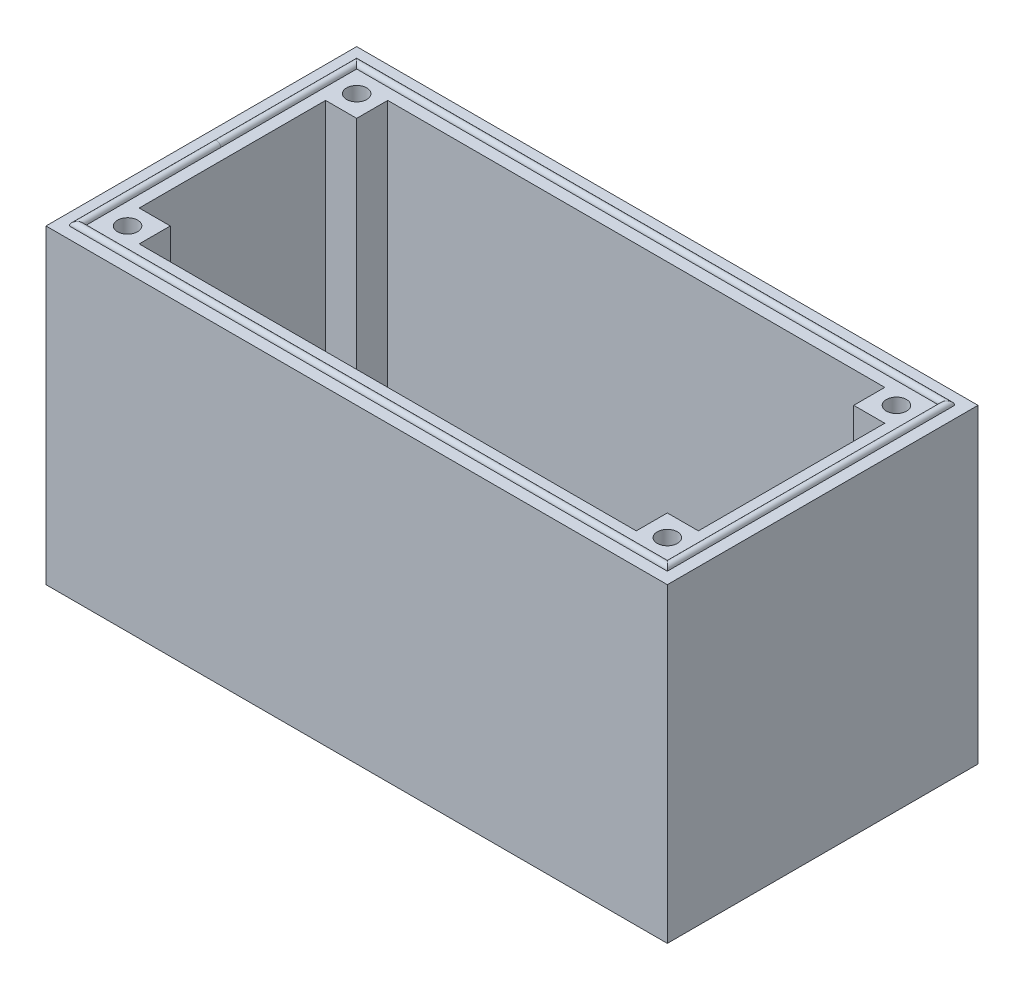
ISO-10303-21;
HEADER;
FILE_DESCRIPTION(('STEP AP214'),'2;1');
FILE_NAME('part.step','',(''),(''),'','','');
FILE_SCHEMA(('AUTOMOTIVE_DESIGN { 1 0 10303 214 1 1 1 1 }'));
ENDSEC;
DATA;
#1=APPLICATION_CONTEXT('core data for automotive mechanical design processes');
#2=APPLICATION_PROTOCOL_DEFINITION('international standard','automotive_design',2000,#1);
#3=PRODUCT_CONTEXT('',#1,'mechanical');
#4=PRODUCT('Part','Part','',(#3));
#5=PRODUCT_RELATED_PRODUCT_CATEGORY('part','',(#4));
#6=PRODUCT_DEFINITION_FORMATION('','',#4);
#7=PRODUCT_DEFINITION_CONTEXT('part definition',#1,'design');
#8=PRODUCT_DEFINITION('design','',#6,#7);
#9=PRODUCT_DEFINITION_SHAPE('','',#8);
#10=(LENGTH_UNIT() NAMED_UNIT(*) SI_UNIT(.MILLI.,.METRE.));
#11=(NAMED_UNIT(*) PLANE_ANGLE_UNIT() SI_UNIT($,.RADIAN.));
#12=(NAMED_UNIT(*) SI_UNIT($,.STERADIAN.) SOLID_ANGLE_UNIT());
#13=UNCERTAINTY_MEASURE_WITH_UNIT(LENGTH_MEASURE(1.E-05),#10,'distance_accuracy_value','');
#14=(GEOMETRIC_REPRESENTATION_CONTEXT(3) GLOBAL_UNCERTAINTY_ASSIGNED_CONTEXT((#13)) GLOBAL_UNIT_ASSIGNED_CONTEXT((#10,
#11,#12)) REPRESENTATION_CONTEXT('',''));
#15=CARTESIAN_POINT('',(0.,0.,0.));
#16=DIRECTION('',(0.,0.,1.));
#17=DIRECTION('',(1.,0.,0.));
#18=AXIS2_PLACEMENT_3D('',#15,#16,#17);
#19=CARTESIAN_POINT('',(40.,0.,-20.));
#20=DIRECTION('',(0.,-1.,0.));
#21=DIRECTION('',(0.,0.,-1.));
#22=AXIS2_PLACEMENT_3D('',#19,#20,#21);
#23=PLANE('',#22);
#24=CARTESIAN_POINT('',(2.62500000000001,0.,-17.375));
#25=DIRECTION('',(0.,-1.,0.));
#26=DIRECTION('',(0.,0.,-1.));
#27=AXIS2_PLACEMENT_3D('',#24,#25,#26);
#28=CIRCLE('',#27,0.675);
#29=CARTESIAN_POINT('',(2.62500000000001,0.,-18.05));
#30=VERTEX_POINT('',#29);
#31=EDGE_CURVE('E789',#30,#30,#28,.T.);
#32=ORIENTED_EDGE('',*,*,#31,.F.);
#33=EDGE_LOOP('',(#32));
#34=FACE_BOUND('',#33,.T.);
#35=CARTESIAN_POINT('',(2.62500000000001,0.,-2.625));
#36=DIRECTION('',(0.,-1.,0.));
#37=DIRECTION('',(0.,0.,-1.));
#38=AXIS2_PLACEMENT_3D('',#35,#36,#37);
#39=CIRCLE('',#38,0.675);
#40=CARTESIAN_POINT('',(2.62500000000001,0.,-3.3));
#41=VERTEX_POINT('',#40);
#42=EDGE_CURVE('E433',#41,#41,#39,.T.);
#43=ORIENTED_EDGE('',*,*,#42,.F.);
#44=EDGE_LOOP('',(#43));
#45=FACE_BOUND('',#44,.T.);
#46=CARTESIAN_POINT('',(37.375,0.,-2.625));
#47=DIRECTION('',(0.,-1.,0.));
#48=DIRECTION('',(0.,0.,-1.));
#49=AXIS2_PLACEMENT_3D('',#46,#47,#48);
#50=CIRCLE('',#49,0.675000000000002);
#51=CARTESIAN_POINT('',(37.375,0.,-3.3));
#52=VERTEX_POINT('',#51);
#53=EDGE_CURVE('E426',#52,#52,#50,.T.);
#54=ORIENTED_EDGE('',*,*,#53,.F.);
#55=EDGE_LOOP('',(#54));
#56=FACE_BOUND('',#55,.T.);
#57=CARTESIAN_POINT('',(37.375,0.,-17.375));
#58=DIRECTION('',(0.,-1.,0.));
#59=DIRECTION('',(0.,0.,-1.));
#60=AXIS2_PLACEMENT_3D('',#57,#58,#59);
#61=CIRCLE('',#60,0.675000000000002);
#62=CARTESIAN_POINT('',(37.375,0.,-18.05));
#63=VERTEX_POINT('',#62);
#64=EDGE_CURVE('E422',#63,#63,#61,.T.);
#65=ORIENTED_EDGE('',*,*,#64,.F.);
#66=EDGE_LOOP('',(#65));
#67=FACE_BOUND('',#66,.T.);
#68=DIRECTION('',(-1.,0.,0.));
#69=VECTOR('',#68,1.);
#70=CARTESIAN_POINT('',(39.375,0.,-18.75));
#71=LINE('',#70,#69);
#72=CARTESIAN_POINT('',(38.75,0.,-18.75));
#73=VERTEX_POINT('',#72);
#74=CARTESIAN_POINT('',(1.25000000000001,0.,-18.75));
#75=VERTEX_POINT('',#74);
#76=EDGE_CURVE('E250',#73,#75,#71,.T.);
#77=ORIENTED_EDGE('',*,*,#76,.F.);
#78=DIRECTION('',(0.,0.,-1.));
#79=VECTOR('',#78,1.);
#80=CARTESIAN_POINT('',(38.75,0.,-0.625000000000001));
#81=LINE('',#80,#79);
#82=CARTESIAN_POINT('',(38.75,0.,-1.25));
#83=VERTEX_POINT('',#82);
#84=EDGE_CURVE('E450',#83,#73,#81,.T.);
#85=ORIENTED_EDGE('',*,*,#84,.F.);
#86=DIRECTION('',(1.,0.,0.));
#87=VECTOR('',#86,1.);
#88=CARTESIAN_POINT('',(0.625000000000002,0.,-1.25));
#89=LINE('',#88,#87);
#90=CARTESIAN_POINT('',(1.25,0.,-1.25));
#91=VERTEX_POINT('',#90);
#92=EDGE_CURVE('E234',#91,#83,#89,.T.);
#93=ORIENTED_EDGE('',*,*,#92,.F.);
#94=DIRECTION('',(0.,0.,1.));
#95=VECTOR('',#94,1.);
#96=CARTESIAN_POINT('',(1.25,0.,-10.));
#97=LINE('',#96,#95);
#98=CARTESIAN_POINT('',(1.25,0.,-10.));
#99=VERTEX_POINT('',#98);
#100=EDGE_CURVE('E63',#99,#91,#97,.T.);
#101=ORIENTED_EDGE('',*,*,#100,.F.);
#102=DIRECTION('',(0.,0.,1.));
#103=VECTOR('',#102,1.);
#104=CARTESIAN_POINT('',(1.25,0.,-19.375));
#105=LINE('',#104,#103);
#106=EDGE_CURVE('E254',#75,#99,#105,.T.);
#107=ORIENTED_EDGE('',*,*,#106,.F.);
#108=EDGE_LOOP('',(#77,#85,#93,#101,#107));
#109=FACE_BOUND('',#108,.T.);
#110=DIRECTION('',(0.,0.,1.));
#111=VECTOR('',#110,1.);
#112=CARTESIAN_POINT('',(36.,0.,-3.99999999999999));
#113=LINE('',#112,#111);
#114=CARTESIAN_POINT('',(36.,0.,-3.99999999999999));
#115=VERTEX_POINT('',#114);
#116=CARTESIAN_POINT('',(36.,0.,-2.));
#117=VERTEX_POINT('',#116);
#118=EDGE_CURVE('E298',#115,#117,#113,.T.);
#119=ORIENTED_EDGE('',*,*,#118,.F.);
#120=DIRECTION('',(-1.,0.,0.));
#121=VECTOR('',#120,1.);
#122=CARTESIAN_POINT('',(38.,0.,-4.));
#123=LINE('',#122,#121);
#124=CARTESIAN_POINT('',(38.,0.,-4.));
#125=VERTEX_POINT('',#124);
#126=EDGE_CURVE('E296',#125,#115,#123,.T.);
#127=ORIENTED_EDGE('',*,*,#126,.F.);
#128=DIRECTION('',(0.,0.,-1.));
#129=VECTOR('',#128,1.);
#130=CARTESIAN_POINT('',(38.,0.,-4.));
#131=LINE('',#130,#129);
#132=CARTESIAN_POINT('',(38.,0.,-16.));
#133=VERTEX_POINT('',#132);
#134=EDGE_CURVE('E325',#125,#133,#131,.T.);
#135=ORIENTED_EDGE('',*,*,#134,.T.);
#136=DIRECTION('',(1.,0.,0.));
#137=VECTOR('',#136,1.);
#138=CARTESIAN_POINT('',(36.,0.,-16.));
#139=LINE('',#138,#137);
#140=CARTESIAN_POINT('',(36.,0.,-16.));
#141=VERTEX_POINT('',#140);
#142=EDGE_CURVE('E322',#141,#133,#139,.T.);
#143=ORIENTED_EDGE('',*,*,#142,.F.);
#144=DIRECTION('',(0.,0.,1.));
#145=VECTOR('',#144,1.);
#146=CARTESIAN_POINT('',(36.,0.,-18.));
#147=LINE('',#146,#145);
#148=CARTESIAN_POINT('',(36.,0.,-18.));
#149=VERTEX_POINT('',#148);
#150=EDGE_CURVE('E320',#149,#141,#147,.T.);
#151=ORIENTED_EDGE('',*,*,#150,.F.);
#152=DIRECTION('',(-1.,0.,0.));
#153=VECTOR('',#152,1.);
#154=CARTESIAN_POINT('',(36.,0.,-18.));
#155=LINE('',#154,#153);
#156=CARTESIAN_POINT('',(3.99999999999999,0.,-18.));
#157=VERTEX_POINT('',#156);
#158=EDGE_CURVE('E317',#149,#157,#155,.T.);
#159=ORIENTED_EDGE('',*,*,#158,.T.);
#160=DIRECTION('',(0.,0.,1.));
#161=VECTOR('',#160,1.);
#162=CARTESIAN_POINT('',(3.99999999999999,0.,-18.));
#163=LINE('',#162,#161);
#164=CARTESIAN_POINT('',(3.99999999999999,0.,-16.));
#165=VERTEX_POINT('',#164);
#166=EDGE_CURVE('E314',#157,#165,#163,.T.);
#167=ORIENTED_EDGE('',*,*,#166,.T.);
#168=DIRECTION('',(-1.,0.,0.));
#169=VECTOR('',#168,1.);
#170=CARTESIAN_POINT('',(3.99999999999999,0.,-16.));
#171=LINE('',#170,#169);
#172=CARTESIAN_POINT('',(2.,0.,-16.));
#173=VERTEX_POINT('',#172);
#174=EDGE_CURVE('E311',#165,#173,#171,.T.);
#175=ORIENTED_EDGE('',*,*,#174,.T.);
#176=DIRECTION('',(0.,0.,-1.));
#177=VECTOR('',#176,1.);
#178=CARTESIAN_POINT('',(2.,0.,-3.99999999999999));
#179=LINE('',#178,#177);
#180=CARTESIAN_POINT('',(2.,0.,-3.99999999999999));
#181=VERTEX_POINT('',#180);
#182=EDGE_CURVE('E309',#181,#173,#179,.T.);
#183=ORIENTED_EDGE('',*,*,#182,.F.);
#184=DIRECTION('',(1.,0.,0.));
#185=VECTOR('',#184,1.);
#186=CARTESIAN_POINT('',(2.,0.,-3.99999999999999));
#187=LINE('',#186,#185);
#188=CARTESIAN_POINT('',(3.99999999999999,0.,-3.99999999999999));
#189=VERTEX_POINT('',#188);
#190=EDGE_CURVE('E306',#181,#189,#187,.T.);
#191=ORIENTED_EDGE('',*,*,#190,.T.);
#192=DIRECTION('',(0.,0.,1.));
#193=VECTOR('',#192,1.);
#194=CARTESIAN_POINT('',(3.99999999999999,0.,-3.99999999999999));
#195=LINE('',#194,#193);
#196=CARTESIAN_POINT('',(3.99999999999999,0.,-2.));
#197=VERTEX_POINT('',#196);
#198=EDGE_CURVE('E303',#189,#197,#195,.T.);
#199=ORIENTED_EDGE('',*,*,#198,.T.);
#200=DIRECTION('',(-1.,0.,0.));
#201=VECTOR('',#200,1.);
#202=CARTESIAN_POINT('',(36.,0.,-2.));
#203=LINE('',#202,#201);
#204=EDGE_CURVE('E301',#117,#197,#203,.T.);
#205=ORIENTED_EDGE('',*,*,#204,.F.);
#206=EDGE_LOOP('',(#119,#127,#135,#143,#151,#159,#167,#175,#183,#191,#199,#205));
#207=FACE_BOUND('',#206,.T.);
#208=ADVANCED_FACE('F46',(#34,#45,#56,#67,#109,#207),#23,.T.);
#209=CARTESIAN_POINT('',(0.,20.,-20.));
#210=DIRECTION('',(0.,1.,0.));
#211=DIRECTION('',(0.,0.,1.));
#212=AXIS2_PLACEMENT_3D('',#209,#210,#211);
#213=PLANE('',#212);
#214=CARTESIAN_POINT('',(2.62500000000001,20.,-17.375));
#215=DIRECTION('',(0.,1.,0.));
#216=DIRECTION('',(0.,0.,1.));
#217=AXIS2_PLACEMENT_3D('',#214,#215,#216);
#218=CIRCLE('',#217,0.649999999999992);
#219=CARTESIAN_POINT('',(2.62500000000001,20.,-16.725));
#220=VERTEX_POINT('',#219);
#221=EDGE_CURVE('E50',#220,#220,#218,.T.);
#222=ORIENTED_EDGE('',*,*,#221,.F.);
#223=EDGE_LOOP('',(#222));
#224=FACE_BOUND('',#223,.T.);
#225=CARTESIAN_POINT('',(2.62500000000001,20.,-2.625));
#226=DIRECTION('',(0.,1.,0.));
#227=DIRECTION('',(0.,0.,1.));
#228=AXIS2_PLACEMENT_3D('',#225,#226,#227);
#229=CIRCLE('',#228,0.649999999999992);
#230=CARTESIAN_POINT('',(2.62500000000001,20.,-1.97500000000001));
#231=VERTEX_POINT('',#230);
#232=EDGE_CURVE('E424',#231,#231,#229,.T.);
#233=ORIENTED_EDGE('',*,*,#232,.F.);
#234=EDGE_LOOP('',(#233));
#235=FACE_BOUND('',#234,.T.);
#236=CARTESIAN_POINT('',(37.375,20.,-2.625));
#237=DIRECTION('',(0.,1.,0.));
#238=DIRECTION('',(0.,0.,1.));
#239=AXIS2_PLACEMENT_3D('',#236,#237,#238);
#240=CIRCLE('',#239,0.649999999999991);
#241=CARTESIAN_POINT('',(37.375,20.,-1.97500000000001));
#242=VERTEX_POINT('',#241);
#243=EDGE_CURVE('E420',#242,#242,#240,.T.);
#244=ORIENTED_EDGE('',*,*,#243,.F.);
#245=EDGE_LOOP('',(#244));
#246=FACE_BOUND('',#245,.T.);
#247=CARTESIAN_POINT('',(37.375,20.,-17.375));
#248=DIRECTION('',(0.,1.,0.));
#249=DIRECTION('',(0.,0.,1.));
#250=AXIS2_PLACEMENT_3D('',#247,#248,#249);
#251=CIRCLE('',#250,0.649999999999991);
#252=CARTESIAN_POINT('',(37.375,20.,-16.725));
#253=VERTEX_POINT('',#252);
#254=EDGE_CURVE('E251',#253,#253,#251,.T.);
#255=ORIENTED_EDGE('',*,*,#254,.F.);
#256=EDGE_LOOP('',(#255));
#257=FACE_BOUND('',#256,.T.);
#258=DIRECTION('',(0.,0.,-1.));
#259=VECTOR('',#258,1.);
#260=CARTESIAN_POINT('',(38.,20.,-4.));
#261=LINE('',#260,#259);
#262=CARTESIAN_POINT('',(38.,20.,-4.));
#263=VERTEX_POINT('',#262);
#264=CARTESIAN_POINT('',(38.,20.,-16.));
#265=VERTEX_POINT('',#264);
#266=EDGE_CURVE('E299',#263,#265,#261,.T.);
#267=ORIENTED_EDGE('',*,*,#266,.F.);
#268=DIRECTION('',(-1.,0.,0.));
#269=VECTOR('',#268,1.);
#270=CARTESIAN_POINT('',(38.,20.,-4.));
#271=LINE('',#270,#269);
#272=CARTESIAN_POINT('',(36.,20.,-3.99999999999999));
#273=VERTEX_POINT('',#272);
#274=EDGE_CURVE('E267',#263,#273,#271,.T.);
#275=ORIENTED_EDGE('',*,*,#274,.T.);
#276=DIRECTION('',(0.,0.,1.));
#277=VECTOR('',#276,1.);
#278=CARTESIAN_POINT('',(36.,20.,-3.99999999999999));
#279=LINE('',#278,#277);
#280=CARTESIAN_POINT('',(36.,20.,-2.));
#281=VERTEX_POINT('',#280);
#282=EDGE_CURVE('E331',#273,#281,#279,.T.);
#283=ORIENTED_EDGE('',*,*,#282,.T.);
#284=DIRECTION('',(-1.,0.,0.));
#285=VECTOR('',#284,1.);
#286=CARTESIAN_POINT('',(36.,20.,-2.));
#287=LINE('',#286,#285);
#288=CARTESIAN_POINT('',(3.99999999999999,20.,-2.));
#289=VERTEX_POINT('',#288);
#290=EDGE_CURVE('E334',#281,#289,#287,.T.);
#291=ORIENTED_EDGE('',*,*,#290,.T.);
#292=DIRECTION('',(0.,0.,1.));
#293=VECTOR('',#292,1.);
#294=CARTESIAN_POINT('',(3.99999999999999,20.,-3.99999999999999));
#295=LINE('',#294,#293);
#296=CARTESIAN_POINT('',(3.99999999999999,20.,-3.99999999999999));
#297=VERTEX_POINT('',#296);
#298=EDGE_CURVE('E337',#297,#289,#295,.T.);
#299=ORIENTED_EDGE('',*,*,#298,.F.);
#300=DIRECTION('',(1.,0.,0.));
#301=VECTOR('',#300,1.);
#302=CARTESIAN_POINT('',(2.,20.,-3.99999999999999));
#303=LINE('',#302,#301);
#304=CARTESIAN_POINT('',(2.,20.,-3.99999999999999));
#305=VERTEX_POINT('',#304);
#306=EDGE_CURVE('E340',#305,#297,#303,.T.);
#307=ORIENTED_EDGE('',*,*,#306,.F.);
#308=DIRECTION('',(0.,0.,-1.));
#309=VECTOR('',#308,1.);
#310=CARTESIAN_POINT('',(2.,20.,-3.99999999999999));
#311=LINE('',#310,#309);
#312=CARTESIAN_POINT('',(2.,20.,-16.));
#313=VERTEX_POINT('',#312);
#314=EDGE_CURVE('E343',#305,#313,#311,.T.);
#315=ORIENTED_EDGE('',*,*,#314,.T.);
#316=DIRECTION('',(-1.,0.,0.));
#317=VECTOR('',#316,1.);
#318=CARTESIAN_POINT('',(3.99999999999999,20.,-16.));
#319=LINE('',#318,#317);
#320=CARTESIAN_POINT('',(3.99999999999999,20.,-16.));
#321=VERTEX_POINT('',#320);
#322=EDGE_CURVE('E346',#321,#313,#319,.T.);
#323=ORIENTED_EDGE('',*,*,#322,.F.);
#324=DIRECTION('',(0.,0.,1.));
#325=VECTOR('',#324,1.);
#326=CARTESIAN_POINT('',(3.99999999999999,20.,-18.));
#327=LINE('',#326,#325);
#328=CARTESIAN_POINT('',(3.99999999999999,20.,-18.));
#329=VERTEX_POINT('',#328);
#330=EDGE_CURVE('E349',#329,#321,#327,.T.);
#331=ORIENTED_EDGE('',*,*,#330,.F.);
#332=DIRECTION('',(-1.,0.,0.));
#333=VECTOR('',#332,1.);
#334=CARTESIAN_POINT('',(36.,20.,-18.));
#335=LINE('',#334,#333);
#336=CARTESIAN_POINT('',(36.,20.,-18.));
#337=VERTEX_POINT('',#336);
#338=EDGE_CURVE('E352',#337,#329,#335,.T.);
#339=ORIENTED_EDGE('',*,*,#338,.F.);
#340=DIRECTION('',(0.,0.,1.));
#341=VECTOR('',#340,1.);
#342=CARTESIAN_POINT('',(36.,20.,-18.));
#343=LINE('',#342,#341);
#344=CARTESIAN_POINT('',(36.,20.,-16.));
#345=VERTEX_POINT('',#344);
#346=EDGE_CURVE('E355',#337,#345,#343,.T.);
#347=ORIENTED_EDGE('',*,*,#346,.T.);
#348=DIRECTION('',(1.,0.,0.));
#349=VECTOR('',#348,1.);
#350=CARTESIAN_POINT('',(36.,20.,-16.));
#351=LINE('',#350,#349);
#352=EDGE_CURVE('E358',#345,#265,#351,.T.);
#353=ORIENTED_EDGE('',*,*,#352,.T.);
#354=EDGE_LOOP('',(#267,#275,#283,#291,#299,#307,#315,#323,#331,#339,#347,#353));
#355=FACE_BOUND('',#354,.T.);
#356=DIRECTION('',(0.,0.,-1.));
#357=VECTOR('',#356,1.);
#358=CARTESIAN_POINT('',(1.24999999999999,20.,-0.624999999999994));
#359=LINE('',#358,#357);
#360=CARTESIAN_POINT('',(1.24999999999999,20.,-1.24999999999999));
#361=VERTEX_POINT('',#360);
#362=CARTESIAN_POINT('',(1.24999999999999,20.,-10.));
#363=VERTEX_POINT('',#362);
#364=EDGE_CURVE('E276',#361,#363,#359,.T.);
#365=ORIENTED_EDGE('',*,*,#364,.F.);
#366=DIRECTION('',(-1.,0.,0.));
#367=VECTOR('',#366,1.);
#368=CARTESIAN_POINT('',(39.375,20.,-1.24999999999999));
#369=LINE('',#368,#367);
#370=CARTESIAN_POINT('',(38.75,20.,-1.24999999999999));
#371=VERTEX_POINT('',#370);
#372=EDGE_CURVE('E279',#371,#361,#369,.T.);
#373=ORIENTED_EDGE('',*,*,#372,.F.);
#374=DIRECTION('',(0.,0.,1.));
#375=VECTOR('',#374,1.);
#376=CARTESIAN_POINT('',(38.75,20.,-19.375));
#377=LINE('',#376,#375);
#378=CARTESIAN_POINT('',(38.75,20.,-18.75));
#379=VERTEX_POINT('',#378);
#380=EDGE_CURVE('E271',#379,#371,#377,.T.);
#381=ORIENTED_EDGE('',*,*,#380,.F.);
#382=DIRECTION('',(1.,0.,0.));
#383=VECTOR('',#382,1.);
#384=CARTESIAN_POINT('',(0.624999999999994,20.,-18.75));
#385=LINE('',#384,#383);
#386=CARTESIAN_POINT('',(1.25,20.,-18.75));
#387=VERTEX_POINT('',#386);
#388=EDGE_CURVE('E264',#387,#379,#385,.T.);
#389=ORIENTED_EDGE('',*,*,#388,.F.);
#390=DIRECTION('',(0.,0.,-1.));
#391=VECTOR('',#390,1.);
#392=CARTESIAN_POINT('',(1.24999999999999,20.,-10.));
#393=LINE('',#392,#391);
#394=EDGE_CURVE('E287',#363,#387,#393,.T.);
#395=ORIENTED_EDGE('',*,*,#394,.F.);
#396=EDGE_LOOP('',(#365,#373,#381,#389,#395));
#397=FACE_BOUND('',#396,.T.);
#398=ADVANCED_FACE('F485',(#224,#235,#246,#257,#355,#397),#213,.T.);
#399=DIRECTION('',(-1.,0.,0.));
#400=VECTOR('',#399,1.);
#401=CARTESIAN_POINT('',(0.,20.,0.));
#402=LINE('',#401,#400);
#403=CARTESIAN_POINT('',(40.,20.,0.));
#404=VERTEX_POINT('',#403);
#405=CARTESIAN_POINT('',(0.,20.,0.));
#406=VERTEX_POINT('',#405);
#407=EDGE_CURVE('E408',#404,#406,#402,.T.);
#408=ORIENTED_EDGE('',*,*,#407,.F.);
#409=DIRECTION('',(0.,0.,1.));
#410=VECTOR('',#409,1.);
#411=CARTESIAN_POINT('',(40.,20.,-20.));
#412=LINE('',#411,#410);
#413=CARTESIAN_POINT('',(40.,20.,-20.));
#414=VERTEX_POINT('',#413);
#415=EDGE_CURVE('E414',#414,#404,#412,.T.);
#416=ORIENTED_EDGE('',*,*,#415,.F.);
#417=DIRECTION('',(-1.,0.,0.));
#418=VECTOR('',#417,1.);
#419=CARTESIAN_POINT('',(0.,20.,-20.));
#420=LINE('',#419,#418);
#421=CARTESIAN_POINT('',(0.,20.,-20.));
#422=VERTEX_POINT('',#421);
#423=EDGE_CURVE('E396',#414,#422,#420,.T.);
#424=ORIENTED_EDGE('',*,*,#423,.T.);
#425=DIRECTION('',(0.,0.,1.));
#426=VECTOR('',#425,1.);
#427=CARTESIAN_POINT('',(0.,20.,-20.));
#428=LINE('',#427,#426);
#429=EDGE_CURVE('E55',#422,#406,#428,.T.);
#430=ORIENTED_EDGE('',*,*,#429,.T.);
#431=EDGE_LOOP('',(#408,#416,#424,#430));
#432=FACE_BOUND('',#431,.T.);
#433=DIRECTION('',(0.,0.,1.));
#434=VECTOR('',#433,1.);
#435=CARTESIAN_POINT('',(39.25,20.,-19.375));
#436=LINE('',#435,#434);
#437=CARTESIAN_POINT('',(39.25,20.,-19.25));
#438=VERTEX_POINT('',#437);
#439=CARTESIAN_POINT('',(39.25,20.,-0.749999999999993));
#440=VERTEX_POINT('',#439);
#441=EDGE_CURVE('E268',#438,#440,#436,.T.);
#442=ORIENTED_EDGE('',*,*,#441,.T.);
#443=DIRECTION('',(-1.,0.,0.));
#444=VECTOR('',#443,1.);
#445=CARTESIAN_POINT('',(39.375,20.,-0.749999999999993));
#446=LINE('',#445,#444);
#447=CARTESIAN_POINT('',(0.749999999999993,20.,-0.749999999999994));
#448=VERTEX_POINT('',#447);
#449=EDGE_CURVE('E291',#440,#448,#446,.T.);
#450=ORIENTED_EDGE('',*,*,#449,.T.);
#451=DIRECTION('',(0.,0.,-1.));
#452=VECTOR('',#451,1.);
#453=CARTESIAN_POINT('',(0.749999999999993,20.,-0.624999999999994));
#454=LINE('',#453,#452);
#455=CARTESIAN_POINT('',(0.749999999999993,20.,-10.));
#456=VERTEX_POINT('',#455);
#457=EDGE_CURVE('E278',#448,#456,#454,.T.);
#458=ORIENTED_EDGE('',*,*,#457,.T.);
#459=DIRECTION('',(0.,0.,-1.));
#460=VECTOR('',#459,1.);
#461=CARTESIAN_POINT('',(0.749999999999993,20.,-10.));
#462=LINE('',#461,#460);
#463=CARTESIAN_POINT('',(0.749999999999994,20.,-19.25));
#464=VERTEX_POINT('',#463);
#465=EDGE_CURVE('E284',#456,#464,#462,.T.);
#466=ORIENTED_EDGE('',*,*,#465,.T.);
#467=DIRECTION('',(1.,0.,0.));
#468=VECTOR('',#467,1.);
#469=CARTESIAN_POINT('',(0.624999999999994,20.,-19.25));
#470=LINE('',#469,#468);
#471=EDGE_CURVE('E257',#464,#438,#470,.T.);
#472=ORIENTED_EDGE('',*,*,#471,.T.);
#473=EDGE_LOOP('',(#442,#450,#458,#466,#472));
#474=FACE_BOUND('',#473,.T.);
#475=ADVANCED_FACE('F491',(#432,#474),#213,.T.);
#476=DIRECTION('',(-1.,0.,0.));
#477=VECTOR('',#476,1.);
#478=CARTESIAN_POINT('',(39.375,0.,-19.25));
#479=LINE('',#478,#477);
#480=CARTESIAN_POINT('',(39.25,0.,-19.25));
#481=VERTEX_POINT('',#480);
#482=CARTESIAN_POINT('',(0.750000000000004,0.,-19.25));
#483=VERTEX_POINT('',#482);
#484=EDGE_CURVE('E248',#481,#483,#479,.T.);
#485=ORIENTED_EDGE('',*,*,#484,.T.);
#486=DIRECTION('',(0.,0.,1.));
#487=VECTOR('',#486,1.);
#488=CARTESIAN_POINT('',(0.750000000000001,0.,-19.375));
#489=LINE('',#488,#487);
#490=CARTESIAN_POINT('',(0.750000000000001,0.,-10.));
#491=VERTEX_POINT('',#490);
#492=EDGE_CURVE('E240',#483,#491,#489,.T.);
#493=ORIENTED_EDGE('',*,*,#492,.T.);
#494=DIRECTION('',(0.,0.,1.));
#495=VECTOR('',#494,1.);
#496=CARTESIAN_POINT('',(0.750000000000001,0.,-10.));
#497=LINE('',#496,#495);
#498=CARTESIAN_POINT('',(0.750000000000001,0.,-0.750000000000002));
#499=VERTEX_POINT('',#498);
#500=EDGE_CURVE('E222',#491,#499,#497,.T.);
#501=ORIENTED_EDGE('',*,*,#500,.T.);
#502=DIRECTION('',(1.,0.,0.));
#503=VECTOR('',#502,1.);
#504=CARTESIAN_POINT('',(0.625000000000002,0.,-0.750000000000002));
#505=LINE('',#504,#503);
#506=CARTESIAN_POINT('',(39.25,0.,-0.750000000000001));
#507=VERTEX_POINT('',#506);
#508=EDGE_CURVE('E231',#499,#507,#505,.T.);
#509=ORIENTED_EDGE('',*,*,#508,.T.);
#510=DIRECTION('',(0.,0.,-1.));
#511=VECTOR('',#510,1.);
#512=CARTESIAN_POINT('',(39.25,0.,-0.625000000000001));
#513=LINE('',#512,#511);
#514=EDGE_CURVE('E71',#507,#481,#513,.T.);
#515=ORIENTED_EDGE('',*,*,#514,.T.);
#516=EDGE_LOOP('',(#485,#493,#501,#509,#515));
#517=FACE_BOUND('',#516,.T.);
#518=DIRECTION('',(1.,0.,0.));
#519=VECTOR('',#518,1.);
#520=CARTESIAN_POINT('',(40.,0.,0.));
#521=LINE('',#520,#519);
#522=CARTESIAN_POINT('',(0.,0.,0.));
#523=VERTEX_POINT('',#522);
#524=CARTESIAN_POINT('',(40.,0.,0.));
#525=VERTEX_POINT('',#524);
#526=EDGE_CURVE('E388',#523,#525,#521,.T.);
#527=ORIENTED_EDGE('',*,*,#526,.F.);
#528=DIRECTION('',(0.,0.,1.));
#529=VECTOR('',#528,1.);
#530=CARTESIAN_POINT('',(0.,0.,-20.));
#531=LINE('',#530,#529);
#532=CARTESIAN_POINT('',(0.,0.,-20.));
#533=VERTEX_POINT('',#532);
#534=EDGE_CURVE('E11',#533,#523,#531,.T.);
#535=ORIENTED_EDGE('',*,*,#534,.F.);
#536=DIRECTION('',(1.,0.,0.));
#537=VECTOR('',#536,1.);
#538=CARTESIAN_POINT('',(40.,0.,-20.));
#539=LINE('',#538,#537);
#540=CARTESIAN_POINT('',(40.,0.,-20.));
#541=VERTEX_POINT('',#540);
#542=EDGE_CURVE('E389',#533,#541,#539,.T.);
#543=ORIENTED_EDGE('',*,*,#542,.T.);
#544=DIRECTION('',(0.,0.,1.));
#545=VECTOR('',#544,1.);
#546=CARTESIAN_POINT('',(40.,0.,-20.));
#547=LINE('',#546,#545);
#548=EDGE_CURVE('E402',#541,#525,#547,.T.);
#549=ORIENTED_EDGE('',*,*,#548,.T.);
#550=EDGE_LOOP('',(#527,#535,#543,#549));
#551=FACE_BOUND('',#550,.T.);
#552=ADVANCED_FACE('F48',(#517,#551),#23,.T.);
#553=CARTESIAN_POINT('',(0.,0.,-20.));
#554=DIRECTION('',(-1.,0.,0.));
#555=DIRECTION('',(0.,-1.,0.));
#556=AXIS2_PLACEMENT_3D('',#553,#554,#555);
#557=PLANE('',#556);
#558=DIRECTION('',(0.,-1.,0.));
#559=VECTOR('',#558,1.);
#560=CARTESIAN_POINT('',(0.,0.,0.));
#561=LINE('',#560,#559);
#562=EDGE_CURVE('E393',#406,#523,#561,.T.);
#563=ORIENTED_EDGE('',*,*,#562,.F.);
#564=ORIENTED_EDGE('',*,*,#429,.F.);
#565=DIRECTION('',(0.,-1.,0.));
#566=VECTOR('',#565,1.);
#567=CARTESIAN_POINT('',(0.,0.,-20.));
#568=LINE('',#567,#566);
#569=EDGE_CURVE('E399',#422,#533,#568,.T.);
#570=ORIENTED_EDGE('',*,*,#569,.T.);
#571=ORIENTED_EDGE('',*,*,#534,.T.);
#572=EDGE_LOOP('',(#563,#564,#570,#571));
#573=FACE_BOUND('',#572,.T.);
#574=ADVANCED_FACE('F497',(#573),#557,.T.);
#575=CARTESIAN_POINT('',(40.,20.,-20.));
#576=DIRECTION('',(1.,0.,0.));
#577=DIRECTION('',(0.,1.,0.));
#578=AXIS2_PLACEMENT_3D('',#575,#576,#577);
#579=PLANE('',#578);
#580=DIRECTION('',(0.,1.,0.));
#581=VECTOR('',#580,1.);
#582=CARTESIAN_POINT('',(40.,20.,0.));
#583=LINE('',#582,#581);
#584=EDGE_CURVE('E405',#525,#404,#583,.T.);
#585=ORIENTED_EDGE('',*,*,#584,.F.);
#586=ORIENTED_EDGE('',*,*,#548,.F.);
#587=DIRECTION('',(0.,1.,0.));
#588=VECTOR('',#587,1.);
#589=CARTESIAN_POINT('',(40.,20.,-20.));
#590=LINE('',#589,#588);
#591=EDGE_CURVE('E392',#541,#414,#590,.T.);
#592=ORIENTED_EDGE('',*,*,#591,.T.);
#593=ORIENTED_EDGE('',*,*,#415,.T.);
#594=EDGE_LOOP('',(#585,#586,#592,#593));
#595=FACE_BOUND('',#594,.T.);
#596=ADVANCED_FACE('F502',(#595),#579,.T.);
#597=CARTESIAN_POINT('',(0.,0.,-20.));
#598=DIRECTION('',(0.,0.,-1.));
#599=DIRECTION('',(-1.,0.,0.));
#600=AXIS2_PLACEMENT_3D('',#597,#598,#599);
#601=PLANE('',#600);
#602=ORIENTED_EDGE('',*,*,#542,.F.);
#603=ORIENTED_EDGE('',*,*,#569,.F.);
#604=ORIENTED_EDGE('',*,*,#423,.F.);
#605=ORIENTED_EDGE('',*,*,#591,.F.);
#606=EDGE_LOOP('',(#602,#603,#604,#605));
#607=FACE_BOUND('',#606,.T.);
#608=ADVANCED_FACE('F515',(#607),#601,.T.);
#609=CARTESIAN_POINT('',(0.,0.,0.));
#610=DIRECTION('',(0.,0.,-1.));
#611=DIRECTION('',(-1.,0.,0.));
#612=AXIS2_PLACEMENT_3D('',#609,#610,#611);
#613=PLANE('',#612);
#614=ORIENTED_EDGE('',*,*,#526,.T.);
#615=ORIENTED_EDGE('',*,*,#584,.T.);
#616=ORIENTED_EDGE('',*,*,#407,.T.);
#617=ORIENTED_EDGE('',*,*,#562,.T.);
#618=EDGE_LOOP('',(#614,#615,#616,#617));
#619=FACE_BOUND('',#618,.T.);
#620=ADVANCED_FACE('F520',(#619),#613,.F.);
#621=CARTESIAN_POINT('',(38.,0.,-4.));
#622=DIRECTION('',(0.,0.,-1.));
#623=DIRECTION('',(-1.,0.,0.));
#624=AXIS2_PLACEMENT_3D('',#621,#622,#623);
#625=PLANE('',#624);
#626=ORIENTED_EDGE('',*,*,#274,.F.);
#627=DIRECTION('',(0.,1.,0.));
#628=VECTOR('',#627,1.);
#629=CARTESIAN_POINT('',(38.,0.,-4.));
#630=LINE('',#629,#628);
#631=EDGE_CURVE('E328',#125,#263,#630,.T.);
#632=ORIENTED_EDGE('',*,*,#631,.F.);
#633=ORIENTED_EDGE('',*,*,#126,.T.);
#634=DIRECTION('',(0.,1.,0.));
#635=VECTOR('',#634,1.);
#636=CARTESIAN_POINT('',(36.,0.,-3.99999999999999));
#637=LINE('',#636,#635);
#638=EDGE_CURVE('E385',#115,#273,#637,.T.);
#639=ORIENTED_EDGE('',*,*,#638,.T.);
#640=EDGE_LOOP('',(#626,#632,#633,#639));
#641=FACE_BOUND('',#640,.T.);
#642=ADVANCED_FACE('F532',(#641),#625,.T.);
#643=CARTESIAN_POINT('',(36.,0.,-3.99999999999999));
#644=DIRECTION('',(-1.,0.,0.));
#645=DIRECTION('',(0.,0.,1.));
#646=AXIS2_PLACEMENT_3D('',#643,#644,#645);
#647=PLANE('',#646);
#648=ORIENTED_EDGE('',*,*,#282,.F.);
#649=ORIENTED_EDGE('',*,*,#638,.F.);
#650=ORIENTED_EDGE('',*,*,#118,.T.);
#651=DIRECTION('',(0.,1.,0.));
#652=VECTOR('',#651,1.);
#653=CARTESIAN_POINT('',(36.,0.,-2.));
#654=LINE('',#653,#652);
#655=EDGE_CURVE('E383',#117,#281,#654,.T.);
#656=ORIENTED_EDGE('',*,*,#655,.T.);
#657=EDGE_LOOP('',(#648,#649,#650,#656));
#658=FACE_BOUND('',#657,.T.);
#659=ADVANCED_FACE('F537',(#658),#647,.T.);
#660=CARTESIAN_POINT('',(36.,0.,-2.));
#661=DIRECTION('',(0.,0.,-1.));
#662=DIRECTION('',(-1.,0.,0.));
#663=AXIS2_PLACEMENT_3D('',#660,#661,#662);
#664=PLANE('',#663);
#665=ORIENTED_EDGE('',*,*,#290,.F.);
#666=ORIENTED_EDGE('',*,*,#655,.F.);
#667=ORIENTED_EDGE('',*,*,#204,.T.);
#668=DIRECTION('',(0.,1.,0.));
#669=VECTOR('',#668,1.);
#670=CARTESIAN_POINT('',(3.99999999999999,0.,-2.));
#671=LINE('',#670,#669);
#672=EDGE_CURVE('E381',#197,#289,#671,.T.);
#673=ORIENTED_EDGE('',*,*,#672,.T.);
#674=EDGE_LOOP('',(#665,#666,#667,#673));
#675=FACE_BOUND('',#674,.T.);
#676=ADVANCED_FACE('F543',(#675),#664,.T.);
#677=CARTESIAN_POINT('',(3.99999999999999,0.,-3.99999999999999));
#678=DIRECTION('',(-1.,0.,0.));
#679=DIRECTION('',(0.,0.,1.));
#680=AXIS2_PLACEMENT_3D('',#677,#678,#679);
#681=PLANE('',#680);
#682=ORIENTED_EDGE('',*,*,#298,.T.);
#683=ORIENTED_EDGE('',*,*,#672,.F.);
#684=ORIENTED_EDGE('',*,*,#198,.F.);
#685=DIRECTION('',(0.,1.,0.));
#686=VECTOR('',#685,1.);
#687=CARTESIAN_POINT('',(3.99999999999999,0.,-3.99999999999999));
#688=LINE('',#687,#686);
#689=EDGE_CURVE('E379',#189,#297,#688,.T.);
#690=ORIENTED_EDGE('',*,*,#689,.T.);
#691=EDGE_LOOP('',(#682,#683,#684,#690));
#692=FACE_BOUND('',#691,.T.);
#693=ADVANCED_FACE('F547',(#692),#681,.F.);
#694=CARTESIAN_POINT('',(2.,0.,-3.99999999999999));
#695=DIRECTION('',(0.,0.,1.));
#696=DIRECTION('',(1.,0.,0.));
#697=AXIS2_PLACEMENT_3D('',#694,#695,#696);
#698=PLANE('',#697);
#699=ORIENTED_EDGE('',*,*,#306,.T.);
#700=ORIENTED_EDGE('',*,*,#689,.F.);
#701=ORIENTED_EDGE('',*,*,#190,.F.);
#702=DIRECTION('',(0.,1.,0.));
#703=VECTOR('',#702,1.);
#704=CARTESIAN_POINT('',(2.,0.,-3.99999999999999));
#705=LINE('',#704,#703);
#706=EDGE_CURVE('E377',#181,#305,#705,.T.);
#707=ORIENTED_EDGE('',*,*,#706,.T.);
#708=EDGE_LOOP('',(#699,#700,#701,#707));
#709=FACE_BOUND('',#708,.T.);
#710=ADVANCED_FACE('F551',(#709),#698,.F.);
#711=CARTESIAN_POINT('',(2.,0.,-3.99999999999999));
#712=DIRECTION('',(1.,0.,0.));
#713=DIRECTION('',(0.,0.,-1.));
#714=AXIS2_PLACEMENT_3D('',#711,#712,#713);
#715=PLANE('',#714);
#716=ORIENTED_EDGE('',*,*,#314,.F.);
#717=ORIENTED_EDGE('',*,*,#706,.F.);
#718=ORIENTED_EDGE('',*,*,#182,.T.);
#719=DIRECTION('',(0.,1.,0.));
#720=VECTOR('',#719,1.);
#721=CARTESIAN_POINT('',(2.,0.,-16.));
#722=LINE('',#721,#720);
#723=EDGE_CURVE('E375',#173,#313,#722,.T.);
#724=ORIENTED_EDGE('',*,*,#723,.T.);
#725=EDGE_LOOP('',(#716,#717,#718,#724));
#726=FACE_BOUND('',#725,.T.);
#727=ADVANCED_FACE('F555',(#726),#715,.T.);
#728=CARTESIAN_POINT('',(3.99999999999999,0.,-16.));
#729=DIRECTION('',(0.,0.,-1.));
#730=DIRECTION('',(-1.,0.,0.));
#731=AXIS2_PLACEMENT_3D('',#728,#729,#730);
#732=PLANE('',#731);
#733=ORIENTED_EDGE('',*,*,#322,.T.);
#734=ORIENTED_EDGE('',*,*,#723,.F.);
#735=ORIENTED_EDGE('',*,*,#174,.F.);
#736=DIRECTION('',(0.,1.,0.));
#737=VECTOR('',#736,1.);
#738=CARTESIAN_POINT('',(3.99999999999999,0.,-16.));
#739=LINE('',#738,#737);
#740=EDGE_CURVE('E373',#165,#321,#739,.T.);
#741=ORIENTED_EDGE('',*,*,#740,.T.);
#742=EDGE_LOOP('',(#733,#734,#735,#741));
#743=FACE_BOUND('',#742,.T.);
#744=ADVANCED_FACE('F559',(#743),#732,.F.);
#745=CARTESIAN_POINT('',(3.99999999999999,0.,-18.));
#746=DIRECTION('',(-1.,0.,0.));
#747=DIRECTION('',(0.,0.,1.));
#748=AXIS2_PLACEMENT_3D('',#745,#746,#747);
#749=PLANE('',#748);
#750=ORIENTED_EDGE('',*,*,#330,.T.);
#751=ORIENTED_EDGE('',*,*,#740,.F.);
#752=ORIENTED_EDGE('',*,*,#166,.F.);
#753=DIRECTION('',(0.,1.,0.));
#754=VECTOR('',#753,1.);
#755=CARTESIAN_POINT('',(3.99999999999999,0.,-18.));
#756=LINE('',#755,#754);
#757=EDGE_CURVE('E371',#157,#329,#756,.T.);
#758=ORIENTED_EDGE('',*,*,#757,.T.);
#759=EDGE_LOOP('',(#750,#751,#752,#758));
#760=FACE_BOUND('',#759,.T.);
#761=ADVANCED_FACE('F563',(#760),#749,.F.);
#762=CARTESIAN_POINT('',(36.,0.,-18.));
#763=DIRECTION('',(0.,0.,-1.));
#764=DIRECTION('',(-1.,0.,0.));
#765=AXIS2_PLACEMENT_3D('',#762,#763,#764);
#766=PLANE('',#765);
#767=ORIENTED_EDGE('',*,*,#338,.T.);
#768=ORIENTED_EDGE('',*,*,#757,.F.);
#769=ORIENTED_EDGE('',*,*,#158,.F.);
#770=DIRECTION('',(0.,1.,0.));
#771=VECTOR('',#770,1.);
#772=CARTESIAN_POINT('',(36.,0.,-18.));
#773=LINE('',#772,#771);
#774=EDGE_CURVE('E369',#149,#337,#773,.T.);
#775=ORIENTED_EDGE('',*,*,#774,.T.);
#776=EDGE_LOOP('',(#767,#768,#769,#775));
#777=FACE_BOUND('',#776,.T.);
#778=ADVANCED_FACE('F567',(#777),#766,.F.);
#779=CARTESIAN_POINT('',(36.,0.,-18.));
#780=DIRECTION('',(-1.,0.,0.));
#781=DIRECTION('',(0.,0.,1.));
#782=AXIS2_PLACEMENT_3D('',#779,#780,#781);
#783=PLANE('',#782);
#784=ORIENTED_EDGE('',*,*,#346,.F.);
#785=ORIENTED_EDGE('',*,*,#774,.F.);
#786=ORIENTED_EDGE('',*,*,#150,.T.);
#787=DIRECTION('',(0.,1.,0.));
#788=VECTOR('',#787,1.);
#789=CARTESIAN_POINT('',(36.,0.,-16.));
#790=LINE('',#789,#788);
#791=EDGE_CURVE('E367',#141,#345,#790,.T.);
#792=ORIENTED_EDGE('',*,*,#791,.T.);
#793=EDGE_LOOP('',(#784,#785,#786,#792));
#794=FACE_BOUND('',#793,.T.);
#795=ADVANCED_FACE('F571',(#794),#783,.T.);
#796=CARTESIAN_POINT('',(36.,0.,-16.));
#797=DIRECTION('',(0.,0.,1.));
#798=DIRECTION('',(1.,0.,0.));
#799=AXIS2_PLACEMENT_3D('',#796,#797,#798);
#800=PLANE('',#799);
#801=ORIENTED_EDGE('',*,*,#352,.F.);
#802=ORIENTED_EDGE('',*,*,#791,.F.);
#803=ORIENTED_EDGE('',*,*,#142,.T.);
#804=DIRECTION('',(0.,1.,0.));
#805=VECTOR('',#804,1.);
#806=CARTESIAN_POINT('',(38.,0.,-16.));
#807=LINE('',#806,#805);
#808=EDGE_CURVE('E365',#133,#265,#807,.T.);
#809=ORIENTED_EDGE('',*,*,#808,.T.);
#810=EDGE_LOOP('',(#801,#802,#803,#809));
#811=FACE_BOUND('',#810,.T.);
#812=ADVANCED_FACE('F575',(#811),#800,.T.);
#813=CARTESIAN_POINT('',(38.,0.,-4.));
#814=DIRECTION('',(1.,0.,0.));
#815=DIRECTION('',(0.,0.,-1.));
#816=AXIS2_PLACEMENT_3D('',#813,#814,#815);
#817=PLANE('',#816);
#818=ORIENTED_EDGE('',*,*,#266,.T.);
#819=ORIENTED_EDGE('',*,*,#808,.F.);
#820=ORIENTED_EDGE('',*,*,#134,.F.);
#821=ORIENTED_EDGE('',*,*,#631,.T.);
#822=EDGE_LOOP('',(#818,#819,#820,#821));
#823=FACE_BOUND('',#822,.T.);
#824=ADVANCED_FACE('F478',(#823),#817,.F.);
#825=CARTESIAN_POINT('',(39.375,20.,-0.999999999999993));
#826=DIRECTION('',(-1.,0.,0.));
#827=DIRECTION('',(0.,0.,1.));
#828=AXIS2_PLACEMENT_3D('',#825,#826,#827);
#829=CYLINDRICAL_SURFACE('',#828,0.25);
#830=ORIENTED_EDGE('',*,*,#449,.F.);
#831=CARTESIAN_POINT('',(39.,20.,-0.999999999999994));
#832=DIRECTION('',(-0.707106781186548,0.,0.707106781186548));
#833=DIRECTION('',(0.707106781186548,0.,0.707106781186548));
#834=AXIS2_PLACEMENT_3D('',#831,#832,#833);
#835=ELLIPSE('',#834,0.353553390593274,0.25);
#836=EDGE_CURVE('E261',#440,#371,#835,.T.);
#837=ORIENTED_EDGE('',*,*,#836,.T.);
#838=ORIENTED_EDGE('',*,*,#372,.T.);
#839=CARTESIAN_POINT('',(0.999999999999993,20.,-0.999999999999994));
#840=DIRECTION('',(-0.707106781186547,0.,-0.707106781186547));
#841=DIRECTION('',(0.707106781186548,0.,-0.707106781186548));
#842=AXIS2_PLACEMENT_3D('',#839,#840,#841);
#843=ELLIPSE('',#842,0.353553390593274,0.25);
#844=EDGE_CURVE('E272',#448,#361,#843,.T.);
#845=ORIENTED_EDGE('',*,*,#844,.F.);
#846=EDGE_LOOP('',(#830,#837,#838,#845));
#847=FACE_BOUND('',#846,.T.);
#848=ADVANCED_FACE('F582',(#847),#829,.T.);
#849=CARTESIAN_POINT('',(0.999999999999993,20.,-0.624999999999994));
#850=DIRECTION('',(0.,0.,-1.));
#851=DIRECTION('',(-1.,0.,0.));
#852=AXIS2_PLACEMENT_3D('',#849,#850,#851);
#853=CYLINDRICAL_SURFACE('',#852,0.25);
#854=ORIENTED_EDGE('',*,*,#844,.T.);
#855=ORIENTED_EDGE('',*,*,#364,.T.);
#856=CARTESIAN_POINT('',(0.999999999999993,20.,-10.));
#857=DIRECTION('',(0.,0.,1.));
#858=DIRECTION('',(1.,0.,0.));
#859=AXIS2_PLACEMENT_3D('',#856,#857,#858);
#860=CIRCLE('',#859,0.25);
#861=EDGE_CURVE('E282',#363,#456,#860,.T.);
#862=ORIENTED_EDGE('',*,*,#861,.T.);
#863=ORIENTED_EDGE('',*,*,#457,.F.);
#864=EDGE_LOOP('',(#854,#855,#862,#863));
#865=FACE_BOUND('',#864,.T.);
#866=ADVANCED_FACE('F586',(#865),#853,.T.);
#867=CARTESIAN_POINT('',(0.999999999999993,20.,-10.));
#868=DIRECTION('',(0.,0.,-1.));
#869=DIRECTION('',(-1.,0.,0.));
#870=AXIS2_PLACEMENT_3D('',#867,#868,#869);
#871=CYLINDRICAL_SURFACE('',#870,0.25);
#872=ORIENTED_EDGE('',*,*,#465,.F.);
#873=ORIENTED_EDGE('',*,*,#861,.F.);
#874=ORIENTED_EDGE('',*,*,#394,.T.);
#875=CARTESIAN_POINT('',(0.999999999999997,20.,-19.));
#876=DIRECTION('',(0.707106781186548,0.,-0.707106781186548));
#877=DIRECTION('',(0.707106781186548,0.,0.707106781186548));
#878=AXIS2_PLACEMENT_3D('',#875,#876,#877);
#879=ELLIPSE('',#878,0.353553390593274,0.25);
#880=EDGE_CURVE('E258',#464,#387,#879,.T.);
#881=ORIENTED_EDGE('',*,*,#880,.F.);
#882=EDGE_LOOP('',(#872,#873,#874,#881));
#883=FACE_BOUND('',#882,.T.);
#884=ADVANCED_FACE('F588',(#883),#871,.T.);
#885=CARTESIAN_POINT('',(39.,20.,-19.375));
#886=DIRECTION('',(0.,0.,1.));
#887=DIRECTION('',(1.,0.,0.));
#888=AXIS2_PLACEMENT_3D('',#885,#886,#887);
#889=CYLINDRICAL_SURFACE('',#888,0.25);
#890=ORIENTED_EDGE('',*,*,#441,.F.);
#891=CARTESIAN_POINT('',(39.,20.,-19.));
#892=DIRECTION('',(0.707106781186548,0.,0.707106781186547));
#893=DIRECTION('',(0.707106781186547,0.,-0.707106781186548));
#894=AXIS2_PLACEMENT_3D('',#891,#892,#893);
#895=ELLIPSE('',#894,0.353553390593274,0.25);
#896=EDGE_CURVE('E255',#438,#379,#895,.T.);
#897=ORIENTED_EDGE('',*,*,#896,.T.);
#898=ORIENTED_EDGE('',*,*,#380,.T.);
#899=ORIENTED_EDGE('',*,*,#836,.F.);
#900=EDGE_LOOP('',(#890,#897,#898,#899));
#901=FACE_BOUND('',#900,.T.);
#902=ADVANCED_FACE('F475',(#901),#889,.T.);
#903=CARTESIAN_POINT('',(0.624999999999994,20.,-19.));
#904=DIRECTION('',(1.,0.,0.));
#905=DIRECTION('',(0.,0.,-1.));
#906=AXIS2_PLACEMENT_3D('',#903,#904,#905);
#907=CYLINDRICAL_SURFACE('',#906,0.25);
#908=ORIENTED_EDGE('',*,*,#880,.T.);
#909=ORIENTED_EDGE('',*,*,#388,.T.);
#910=ORIENTED_EDGE('',*,*,#896,.F.);
#911=ORIENTED_EDGE('',*,*,#471,.F.);
#912=EDGE_LOOP('',(#908,#909,#910,#911));
#913=FACE_BOUND('',#912,.T.);
#914=ADVANCED_FACE('F467',(#913),#907,.T.);
#915=CARTESIAN_POINT('',(39.375,0.,-19.));
#916=DIRECTION('',(-1.,0.,0.));
#917=DIRECTION('',(0.,0.,1.));
#918=AXIS2_PLACEMENT_3D('',#915,#916,#917);
#919=CYLINDRICAL_SURFACE('',#918,0.25);
#920=ORIENTED_EDGE('',*,*,#484,.F.);
#921=CARTESIAN_POINT('',(39.,0.,-19.));
#922=DIRECTION('',(-0.707106781186548,0.,-0.707106781186547));
#923=DIRECTION('',(0.707106781186547,0.,-0.707106781186548));
#924=AXIS2_PLACEMENT_3D('',#921,#922,#923);
#925=ELLIPSE('',#924,0.353553390593274,0.25);
#926=EDGE_CURVE('E228',#481,#73,#925,.F.);
#927=ORIENTED_EDGE('',*,*,#926,.T.);
#928=ORIENTED_EDGE('',*,*,#76,.T.);
#929=CARTESIAN_POINT('',(1.,0.,-19.));
#930=DIRECTION('',(-0.707106781186547,0.,0.707106781186547));
#931=DIRECTION('',(0.707106781186548,0.,0.707106781186548));
#932=AXIS2_PLACEMENT_3D('',#929,#930,#931);
#933=ELLIPSE('',#932,0.353553390593274,0.25);
#934=EDGE_CURVE('E241',#483,#75,#933,.F.);
#935=ORIENTED_EDGE('',*,*,#934,.F.);
#936=EDGE_LOOP('',(#920,#927,#928,#935));
#937=FACE_BOUND('',#936,.T.);
#938=ADVANCED_FACE('F465',(#937),#919,.F.);
#939=CARTESIAN_POINT('',(1.,0.,-19.375));
#940=DIRECTION('',(0.,0.,1.));
#941=DIRECTION('',(1.,0.,0.));
#942=AXIS2_PLACEMENT_3D('',#939,#940,#941);
#943=CYLINDRICAL_SURFACE('',#942,0.25);
#944=ORIENTED_EDGE('',*,*,#934,.T.);
#945=ORIENTED_EDGE('',*,*,#106,.T.);
#946=CARTESIAN_POINT('',(1.,0.,-10.));
#947=DIRECTION('',(0.,0.,1.));
#948=DIRECTION('',(1.,0.,0.));
#949=AXIS2_PLACEMENT_3D('',#946,#947,#948);
#950=CIRCLE('',#949,0.25);
#951=EDGE_CURVE('E244',#99,#491,#950,.T.);
#952=ORIENTED_EDGE('',*,*,#951,.T.);
#953=ORIENTED_EDGE('',*,*,#492,.F.);
#954=EDGE_LOOP('',(#944,#945,#952,#953));
#955=FACE_BOUND('',#954,.T.);
#956=ADVANCED_FACE('F456',(#955),#943,.F.);
#957=CARTESIAN_POINT('',(1.,0.,-10.));
#958=DIRECTION('',(0.,0.,1.));
#959=DIRECTION('',(1.,0.,0.));
#960=AXIS2_PLACEMENT_3D('',#957,#958,#959);
#961=CYLINDRICAL_SURFACE('',#960,0.25);
#962=ORIENTED_EDGE('',*,*,#500,.F.);
#963=ORIENTED_EDGE('',*,*,#951,.F.);
#964=ORIENTED_EDGE('',*,*,#100,.T.);
#965=CARTESIAN_POINT('',(1.,0.,-1.));
#966=DIRECTION('',(0.707106781186548,0.,0.707106781186548));
#967=DIRECTION('',(0.707106781186548,0.,-0.707106781186548));
#968=AXIS2_PLACEMENT_3D('',#965,#966,#967);
#969=ELLIPSE('',#968,0.353553390593274,0.25);
#970=EDGE_CURVE('E218',#499,#91,#969,.F.);
#971=ORIENTED_EDGE('',*,*,#970,.F.);
#972=EDGE_LOOP('',(#962,#963,#964,#971));
#973=FACE_BOUND('',#972,.T.);
#974=ADVANCED_FACE('F220',(#973),#961,.F.);
#975=CARTESIAN_POINT('',(39.,0.,-0.625000000000001));
#976=DIRECTION('',(0.,0.,-1.));
#977=DIRECTION('',(-1.,0.,0.));
#978=AXIS2_PLACEMENT_3D('',#975,#976,#977);
#979=CYLINDRICAL_SURFACE('',#978,0.25);
#980=ORIENTED_EDGE('',*,*,#514,.F.);
#981=CARTESIAN_POINT('',(39.,0.,-1.));
#982=DIRECTION('',(0.707106781186548,0.,-0.707106781186548));
#983=DIRECTION('',(0.707106781186548,0.,0.707106781186548));
#984=AXIS2_PLACEMENT_3D('',#981,#982,#983);
#985=ELLIPSE('',#984,0.353553390593274,0.25);
#986=EDGE_CURVE('E227',#507,#83,#985,.F.);
#987=ORIENTED_EDGE('',*,*,#986,.T.);
#988=ORIENTED_EDGE('',*,*,#84,.T.);
#989=ORIENTED_EDGE('',*,*,#926,.F.);
#990=EDGE_LOOP('',(#980,#987,#988,#989));
#991=FACE_BOUND('',#990,.T.);
#992=ADVANCED_FACE('F462',(#991),#979,.F.);
#993=CARTESIAN_POINT('',(0.625000000000002,0.,-1.));
#994=DIRECTION('',(1.,0.,0.));
#995=DIRECTION('',(0.,0.,-1.));
#996=AXIS2_PLACEMENT_3D('',#993,#994,#995);
#997=CYLINDRICAL_SURFACE('',#996,0.25);
#998=ORIENTED_EDGE('',*,*,#970,.T.);
#999=ORIENTED_EDGE('',*,*,#92,.T.);
#1000=ORIENTED_EDGE('',*,*,#986,.F.);
#1001=ORIENTED_EDGE('',*,*,#508,.F.);
#1002=EDGE_LOOP('',(#998,#999,#1000,#1001));
#1003=FACE_BOUND('',#1002,.T.);
#1004=ADVANCED_FACE('F232',(#1003),#997,.F.);
#1005=CARTESIAN_POINT('',(37.375,0.,-17.375));
#1006=DIRECTION('',(0.,-1.,0.));
#1007=DIRECTION('',(0.,0.,-1.));
#1008=AXIS2_PLACEMENT_3D('',#1005,#1006,#1007);
#1009=CYLINDRICAL_SURFACE('',#1008,0.649999999999991);
#1010=ORIENTED_EDGE('',*,*,#254,.T.);
#1011=EDGE_LOOP('',(#1010));
#1012=FACE_BOUND('',#1011,.T.);
#1013=CARTESIAN_POINT('',(37.375,0.0249999999999972,-17.375));
#1014=DIRECTION('',(0.,-1.,0.));
#1015=DIRECTION('',(0.,0.,-1.));
#1016=AXIS2_PLACEMENT_3D('',#1013,#1014,#1015);
#1017=CIRCLE('',#1016,0.649999999999984);
#1018=CARTESIAN_POINT('',(37.375,0.0249999999999972,-18.025));
#1019=VERTEX_POINT('',#1018);
#1020=EDGE_CURVE('E419',#1019,#1019,#1017,.T.);
#1021=ORIENTED_EDGE('',*,*,#1020,.T.);
#1022=EDGE_LOOP('',(#1021));
#1023=FACE_BOUND('',#1022,.T.);
#1024=ADVANCED_FACE('F469',(#1012,#1023),#1009,.F.);
#1025=CARTESIAN_POINT('',(37.375,0.,-17.375));
#1026=DIRECTION('',(0.,-1.,0.));
#1027=DIRECTION('',(0.,0.,-1.));
#1028=AXIS2_PLACEMENT_3D('',#1025,#1026,#1027);
#1029=CONICAL_SURFACE('',#1028,0.675000000000002,0.78539816339783);
#1030=ORIENTED_EDGE('',*,*,#1020,.F.);
#1031=EDGE_LOOP('',(#1030));
#1032=FACE_BOUND('',#1031,.T.);
#1033=ORIENTED_EDGE('',*,*,#64,.T.);
#1034=EDGE_LOOP('',(#1033));
#1035=FACE_BOUND('',#1034,.T.);
#1036=ADVANCED_FACE('F481',(#1032,#1035),#1029,.F.);
#1037=CARTESIAN_POINT('',(37.375,0.,-2.625));
#1038=DIRECTION('',(0.,-1.,0.));
#1039=DIRECTION('',(0.,0.,-1.));
#1040=AXIS2_PLACEMENT_3D('',#1037,#1038,#1039);
#1041=CYLINDRICAL_SURFACE('',#1040,0.649999999999991);
#1042=ORIENTED_EDGE('',*,*,#243,.T.);
#1043=EDGE_LOOP('',(#1042));
#1044=FACE_BOUND('',#1043,.T.);
#1045=CARTESIAN_POINT('',(37.375,0.0249999999999972,-2.625));
#1046=DIRECTION('',(0.,-1.,0.));
#1047=DIRECTION('',(0.,0.,-1.));
#1048=AXIS2_PLACEMENT_3D('',#1045,#1046,#1047);
#1049=CIRCLE('',#1048,0.649999999999984);
#1050=CARTESIAN_POINT('',(37.375,0.0249999999999972,-3.27499999999998));
#1051=VERTEX_POINT('',#1050);
#1052=EDGE_CURVE('E423',#1051,#1051,#1049,.T.);
#1053=ORIENTED_EDGE('',*,*,#1052,.T.);
#1054=EDGE_LOOP('',(#1053));
#1055=FACE_BOUND('',#1054,.T.);
#1056=ADVANCED_FACE('F686',(#1044,#1055),#1041,.F.);
#1057=CARTESIAN_POINT('',(37.375,0.,-2.625));
#1058=DIRECTION('',(0.,-1.,0.));
#1059=DIRECTION('',(0.,0.,-1.));
#1060=AXIS2_PLACEMENT_3D('',#1057,#1058,#1059);
#1061=CONICAL_SURFACE('',#1060,0.675000000000002,0.78539816339783);
#1062=ORIENTED_EDGE('',*,*,#1052,.F.);
#1063=EDGE_LOOP('',(#1062));
#1064=FACE_BOUND('',#1063,.T.);
#1065=ORIENTED_EDGE('',*,*,#53,.T.);
#1066=EDGE_LOOP('',(#1065));
#1067=FACE_BOUND('',#1066,.T.);
#1068=ADVANCED_FACE('F698',(#1064,#1067),#1061,.F.);
#1069=CARTESIAN_POINT('',(2.62500000000001,0.,-2.625));
#1070=DIRECTION('',(0.,-1.,0.));
#1071=DIRECTION('',(0.,0.,-1.));
#1072=AXIS2_PLACEMENT_3D('',#1069,#1070,#1071);
#1073=CYLINDRICAL_SURFACE('',#1072,0.649999999999992);
#1074=ORIENTED_EDGE('',*,*,#232,.T.);
#1075=EDGE_LOOP('',(#1074));
#1076=FACE_BOUND('',#1075,.T.);
#1077=CARTESIAN_POINT('',(2.62500000000001,0.0249999999999972,-2.625));
#1078=DIRECTION('',(0.,-1.,0.));
#1079=DIRECTION('',(0.,0.,-1.));
#1080=AXIS2_PLACEMENT_3D('',#1077,#1078,#1079);
#1081=CIRCLE('',#1080,0.649999999999987);
#1082=CARTESIAN_POINT('',(2.62500000000001,0.0249999999999972,-3.27499999999999));
#1083=VERTEX_POINT('',#1082);
#1084=EDGE_CURVE('E427',#1083,#1083,#1081,.T.);
#1085=ORIENTED_EDGE('',*,*,#1084,.T.);
#1086=EDGE_LOOP('',(#1085));
#1087=FACE_BOUND('',#1086,.T.);
#1088=ADVANCED_FACE('F709',(#1076,#1087),#1073,.F.);
#1089=CARTESIAN_POINT('',(2.62500000000001,0.,-2.625));
#1090=DIRECTION('',(0.,-1.,0.));
#1091=DIRECTION('',(0.,0.,-1.));
#1092=AXIS2_PLACEMENT_3D('',#1089,#1090,#1091);
#1093=CONICAL_SURFACE('',#1092,0.675,0.785398163397726);
#1094=ORIENTED_EDGE('',*,*,#1084,.F.);
#1095=EDGE_LOOP('',(#1094));
#1096=FACE_BOUND('',#1095,.T.);
#1097=ORIENTED_EDGE('',*,*,#42,.T.);
#1098=EDGE_LOOP('',(#1097));
#1099=FACE_BOUND('',#1098,.T.);
#1100=ADVANCED_FACE('F721',(#1096,#1099),#1093,.F.);
#1101=CARTESIAN_POINT('',(2.62500000000001,0.,-17.375));
#1102=DIRECTION('',(0.,-1.,0.));
#1103=DIRECTION('',(0.,0.,-1.));
#1104=AXIS2_PLACEMENT_3D('',#1101,#1102,#1103);
#1105=CYLINDRICAL_SURFACE('',#1104,0.649999999999992);
#1106=ORIENTED_EDGE('',*,*,#221,.T.);
#1107=EDGE_LOOP('',(#1106));
#1108=FACE_BOUND('',#1107,.T.);
#1109=CARTESIAN_POINT('',(2.62500000000001,0.0249999999999972,-17.375));
#1110=DIRECTION('',(0.,-1.,0.));
#1111=DIRECTION('',(0.,0.,-1.));
#1112=AXIS2_PLACEMENT_3D('',#1109,#1110,#1111);
#1113=CIRCLE('',#1112,0.649999999999987);
#1114=CARTESIAN_POINT('',(2.62500000000001,0.0249999999999972,-18.025));
#1115=VERTEX_POINT('',#1114);
#1116=EDGE_CURVE('E787',#1115,#1115,#1113,.T.);
#1117=ORIENTED_EDGE('',*,*,#1116,.T.);
#1118=EDGE_LOOP('',(#1117));
#1119=FACE_BOUND('',#1118,.T.);
#1120=ADVANCED_FACE('F732',(#1108,#1119),#1105,.F.);
#1121=CARTESIAN_POINT('',(2.62500000000001,0.,-17.375));
#1122=DIRECTION('',(0.,-1.,0.));
#1123=DIRECTION('',(0.,0.,-1.));
#1124=AXIS2_PLACEMENT_3D('',#1121,#1122,#1123);
#1125=CONICAL_SURFACE('',#1124,0.675,0.785398163397726);
#1126=ORIENTED_EDGE('',*,*,#1116,.F.);
#1127=EDGE_LOOP('',(#1126));
#1128=FACE_BOUND('',#1127,.T.);
#1129=ORIENTED_EDGE('',*,*,#31,.T.);
#1130=EDGE_LOOP('',(#1129));
#1131=FACE_BOUND('',#1130,.T.);
#1132=ADVANCED_FACE('F744',(#1128,#1131),#1125,.F.);
#1133=CLOSED_SHELL('',(#208,#398,#475,#552,#574,#596,#608,#620,#642,#659,#676,#693,#710,#727,
#744,#761,#778,#795,#812,#824,#848,#866,#884,#902,#914,#938,#956,#974,#992,#1004,#1024,#1036,
#1056,#1068,#1088,#1100,#1120,#1132));
#1134=MANIFOLD_SOLID_BREP('B2',#1133);
#1135=ADVANCED_BREP_SHAPE_REPRESENTATION('',(#18,#1134),#14);
#1136=SHAPE_DEFINITION_REPRESENTATION(#9,#1135);
ENDSEC;
END-ISO-10303-21;
